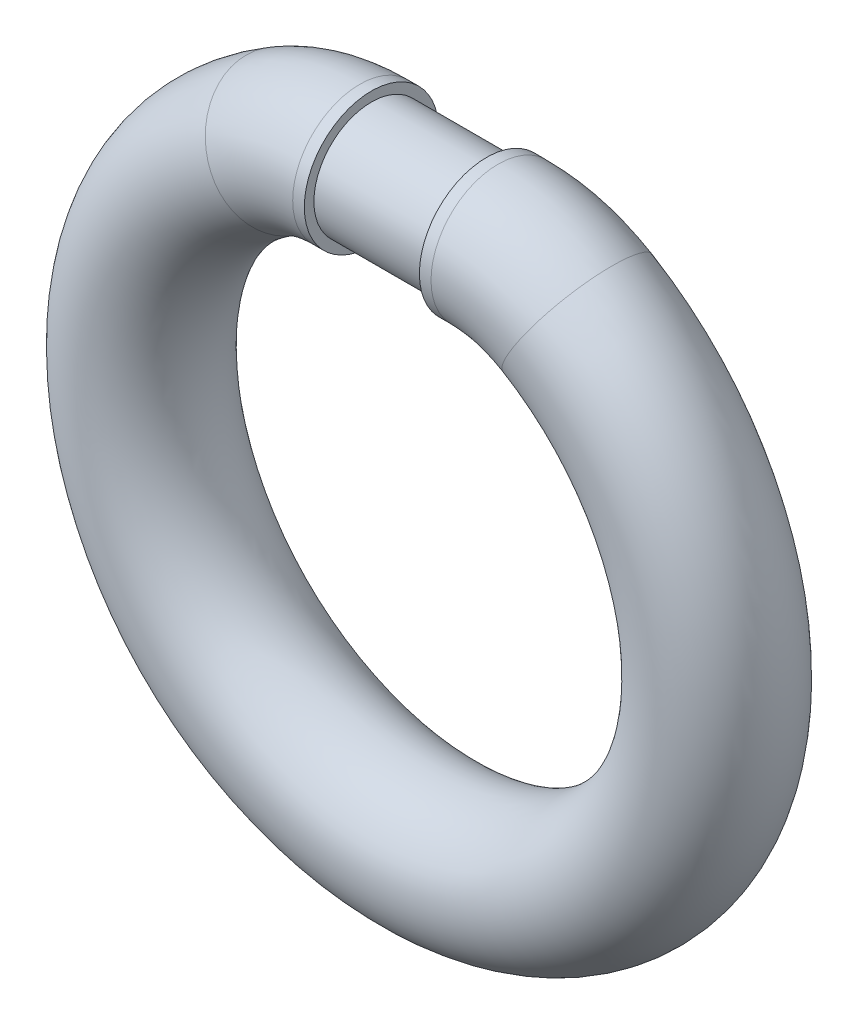
ISO-10303-21;
HEADER;
FILE_DESCRIPTION(('STEP AP214'),'2;1');
FILE_NAME('part.step','',(''),(''),'','','');
FILE_SCHEMA(('AUTOMOTIVE_DESIGN { 1 0 10303 214 1 1 1 1 }'));
ENDSEC;
DATA;
#1=APPLICATION_CONTEXT('core data for automotive mechanical design processes');
#2=APPLICATION_PROTOCOL_DEFINITION('international standard','automotive_design',2000,#1);
#3=PRODUCT_CONTEXT('',#1,'mechanical');
#4=PRODUCT('Part','Part','',(#3));
#5=PRODUCT_RELATED_PRODUCT_CATEGORY('part','',(#4));
#6=PRODUCT_DEFINITION_FORMATION('','',#4);
#7=PRODUCT_DEFINITION_CONTEXT('part definition',#1,'design');
#8=PRODUCT_DEFINITION('design','',#6,#7);
#9=PRODUCT_DEFINITION_SHAPE('','',#8);
#10=(LENGTH_UNIT() NAMED_UNIT(*) SI_UNIT(.MILLI.,.METRE.));
#11=(NAMED_UNIT(*) PLANE_ANGLE_UNIT() SI_UNIT($,.RADIAN.));
#12=(NAMED_UNIT(*) SI_UNIT($,.STERADIAN.) SOLID_ANGLE_UNIT());
#13=UNCERTAINTY_MEASURE_WITH_UNIT(LENGTH_MEASURE(1.E-05),#10,'distance_accuracy_value','');
#14=(GEOMETRIC_REPRESENTATION_CONTEXT(3) GLOBAL_UNCERTAINTY_ASSIGNED_CONTEXT((#13)) GLOBAL_UNIT_ASSIGNED_CONTEXT((#10,
#11,#12)) REPRESENTATION_CONTEXT('',''));
#15=CARTESIAN_POINT('',(0.,0.,0.));
#16=DIRECTION('',(0.,0.,1.));
#17=DIRECTION('',(1.,0.,0.));
#18=AXIS2_PLACEMENT_3D('',#15,#16,#17);
#19=CARTESIAN_POINT('',(-30.,0.,0.));
#20=DIRECTION('',(-1.,0.,0.));
#21=DIRECTION('',(0.,0.,1.));
#22=AXIS2_PLACEMENT_3D('',#19,#20,#21);
#23=PLANE('',#22);
#24=CARTESIAN_POINT('',(-30.,0.,0.));
#25=DIRECTION('',(-1.,0.,0.));
#26=DIRECTION('',(0.,0.,1.));
#27=AXIS2_PLACEMENT_3D('',#24,#25,#26);
#28=CIRCLE('',#27,30.);
#29=CARTESIAN_POINT('',(-30.,0.,30.));
#30=VERTEX_POINT('',#29);
#31=EDGE_CURVE('E11',#30,#30,#28,.T.);
#32=ORIENTED_EDGE('',*,*,#31,.T.);
#33=EDGE_LOOP('',(#32));
#34=FACE_BOUND('',#33,.T.);
#35=CARTESIAN_POINT('',(-30.,0.,0.));
#36=DIRECTION('',(-1.,0.,0.));
#37=DIRECTION('',(0.,0.,1.));
#38=AXIS2_PLACEMENT_3D('',#35,#36,#37);
#39=CIRCLE('',#38,35.);
#40=CARTESIAN_POINT('',(-30.,0.,35.));
#41=VERTEX_POINT('',#40);
#42=EDGE_CURVE('E48',#41,#41,#39,.T.);
#43=ORIENTED_EDGE('',*,*,#42,.F.);
#44=EDGE_LOOP('',(#43));
#45=FACE_BOUND('',#44,.T.);
#46=ADVANCED_FACE('F35',(#34,#45),#23,.F.);
#47=CARTESIAN_POINT('',(30.,0.,0.));
#48=DIRECTION('',(-1.,0.,0.));
#49=DIRECTION('',(0.,0.,1.));
#50=AXIS2_PLACEMENT_3D('',#47,#48,#49);
#51=PLANE('',#50);
#52=CARTESIAN_POINT('',(30.,0.,0.));
#53=DIRECTION('',(-1.,0.,0.));
#54=DIRECTION('',(0.,0.,1.));
#55=AXIS2_PLACEMENT_3D('',#52,#53,#54);
#56=CIRCLE('',#55,30.);
#57=CARTESIAN_POINT('',(30.,0.,30.));
#58=VERTEX_POINT('',#57);
#59=EDGE_CURVE('E39',#58,#58,#56,.T.);
#60=ORIENTED_EDGE('',*,*,#59,.F.);
#61=EDGE_LOOP('',(#60));
#62=FACE_BOUND('',#61,.T.);
#63=CARTESIAN_POINT('',(30.,0.,0.));
#64=DIRECTION('',(-1.,0.,0.));
#65=DIRECTION('',(0.,0.,1.));
#66=AXIS2_PLACEMENT_3D('',#63,#64,#65);
#67=CIRCLE('',#66,35.);
#68=CARTESIAN_POINT('',(30.,0.,35.));
#69=VERTEX_POINT('',#68);
#70=EDGE_CURVE('E52',#69,#69,#67,.T.);
#71=ORIENTED_EDGE('',*,*,#70,.T.);
#72=EDGE_LOOP('',(#71));
#73=FACE_BOUND('',#72,.T.);
#74=ADVANCED_FACE('F53',(#62,#73),#51,.T.);
#75=CARTESIAN_POINT('',(-30.,0.,0.));
#76=DIRECTION('',(-1.,0.,0.));
#77=DIRECTION('',(0.,0.,1.));
#78=AXIS2_PLACEMENT_3D('',#75,#76,#77);
#79=CYLINDRICAL_SURFACE('',#78,35.);
#80=CARTESIAN_POINT('',(-36.0555127546398,0.,0.));
#81=DIRECTION('',(-1.,0.,0.));
#82=DIRECTION('',(0.,0.,1.));
#83=AXIS2_PLACEMENT_3D('',#80,#81,#82);
#84=CIRCLE('',#83,35.);
#85=CARTESIAN_POINT('',(-36.0555127546398,35.,0.));
#86=VERTEX_POINT('',#85);
#87=EDGE_CURVE('E67',#86,#86,#84,.T.);
#88=ORIENTED_EDGE('',*,*,#87,.F.);
#89=EDGE_LOOP('',(#88));
#90=FACE_BOUND('',#89,.T.);
#91=ORIENTED_EDGE('',*,*,#42,.T.);
#92=EDGE_LOOP('',(#91));
#93=FACE_BOUND('',#92,.T.);
#94=ADVANCED_FACE('F71',(#90,#93),#79,.T.);
#95=CARTESIAN_POINT('',(-36.0555127546398,-80.,0.));
#96=DIRECTION('',(0.,0.,1.));
#97=DIRECTION('',(1.,0.,0.));
#98=AXIS2_PLACEMENT_3D('',#95,#96,#97);
#99=TOROIDAL_SURFACE('',#98,80.,35.);
#100=CARTESIAN_POINT('',(-77.2618130456568,-11.4285714285714,0.));
#101=DIRECTION('',(-0.857142857142857,-0.515078753637712,0.));
#102=DIRECTION('',(0.,0.,1.));
#103=AXIS2_PLACEMENT_3D('',#100,#101,#102);
#104=CIRCLE('',#103,35.);
#105=CARTESIAN_POINT('',(-95.2895694229768,18.5714285714286,0.));
#106=VERTEX_POINT('',#105);
#107=EDGE_CURVE('E64',#106,#106,#104,.T.);
#108=CARTESIAN_POINT('',(-36.0555127546398,-80.,0.));
#109=DIRECTION('',(0.,0.,1.));
#110=DIRECTION('',(1.,0.,0.));
#111=AXIS2_PLACEMENT_3D('',#108,#109,#110);
#112=CIRCLE('',#111,115.);
#113=EDGE_CURVE('',#86,#106,#112,.T.);
#114=ORIENTED_EDGE('',*,*,#87,.T.);
#115=ORIENTED_EDGE('',*,*,#107,.F.);
#116=ORIENTED_EDGE('',*,*,#113,.T.);
#117=ORIENTED_EDGE('',*,*,#113,.F.);
#118=EDGE_LOOP('',(#114,#116,#115,#117));
#119=FACE_BOUND('',#118,.T.);
#120=ADVANCED_FACE('F73',(#119),#99,.T.);
#121=CARTESIAN_POINT('',(0.,-140.,0.));
#122=DIRECTION('',(0.,0.,1.));
#123=DIRECTION('',(1.,0.,0.));
#124=AXIS2_PLACEMENT_3D('',#121,#122,#123);
#125=TOROIDAL_SURFACE('',#124,150.,35.);
#126=CARTESIAN_POINT('',(77.2618130456569,-11.4285714285714,0.));
#127=DIRECTION('',(-0.857142857142857,0.515078753637712,0.));
#128=DIRECTION('',(0.,0.,1.));
#129=AXIS2_PLACEMENT_3D('',#126,#127,#128);
#130=CIRCLE('',#129,35.);
#131=CARTESIAN_POINT('',(95.2895694229769,18.5714285714286,0.));
#132=VERTEX_POINT('',#131);
#133=EDGE_CURVE('E59',#132,#132,#130,.T.);
#134=CARTESIAN_POINT('',(0.,-140.,0.));
#135=DIRECTION('',(0.,0.,1.));
#136=DIRECTION('',(1.,0.,0.));
#137=AXIS2_PLACEMENT_3D('',#134,#135,#136);
#138=CIRCLE('',#137,185.);
#139=EDGE_CURVE('',#106,#132,#138,.T.);
#140=ORIENTED_EDGE('',*,*,#107,.T.);
#141=ORIENTED_EDGE('',*,*,#133,.F.);
#142=ORIENTED_EDGE('',*,*,#139,.T.);
#143=ORIENTED_EDGE('',*,*,#139,.F.);
#144=EDGE_LOOP('',(#140,#142,#141,#143));
#145=FACE_BOUND('',#144,.T.);
#146=ADVANCED_FACE('F80',(#145),#125,.T.);
#147=CARTESIAN_POINT('',(36.0555127546399,-80.,0.));
#148=DIRECTION('',(0.,0.,1.));
#149=DIRECTION('',(1.,0.,0.));
#150=AXIS2_PLACEMENT_3D('',#147,#148,#149);
#151=TOROIDAL_SURFACE('',#150,80.,35.);
#152=CARTESIAN_POINT('',(36.0555127546399,0.,0.));
#153=DIRECTION('',(-1.,0.,0.));
#154=DIRECTION('',(0.,0.,1.));
#155=AXIS2_PLACEMENT_3D('',#152,#153,#154);
#156=CIRCLE('',#155,35.);
#157=CARTESIAN_POINT('',(36.0555127546399,35.,0.));
#158=VERTEX_POINT('',#157);
#159=EDGE_CURVE('E55',#158,#158,#156,.T.);
#160=CARTESIAN_POINT('',(36.0555127546399,-80.,0.));
#161=DIRECTION('',(0.,0.,1.));
#162=DIRECTION('',(1.,0.,0.));
#163=AXIS2_PLACEMENT_3D('',#160,#161,#162);
#164=CIRCLE('',#163,115.);
#165=EDGE_CURVE('',#132,#158,#164,.T.);
#166=ORIENTED_EDGE('',*,*,#133,.T.);
#167=ORIENTED_EDGE('',*,*,#159,.F.);
#168=ORIENTED_EDGE('',*,*,#165,.T.);
#169=ORIENTED_EDGE('',*,*,#165,.F.);
#170=EDGE_LOOP('',(#166,#168,#167,#169));
#171=FACE_BOUND('',#170,.T.);
#172=ADVANCED_FACE('F88',(#171),#151,.T.);
#173=CARTESIAN_POINT('',(36.0555127546399,0.,0.));
#174=DIRECTION('',(-1.,0.,0.));
#175=DIRECTION('',(0.,0.,1.));
#176=AXIS2_PLACEMENT_3D('',#173,#174,#175);
#177=CYLINDRICAL_SURFACE('',#176,35.);
#178=ORIENTED_EDGE('',*,*,#70,.F.);
#179=EDGE_LOOP('',(#178));
#180=FACE_BOUND('',#179,.T.);
#181=ORIENTED_EDGE('',*,*,#159,.T.);
#182=EDGE_LOOP('',(#181));
#183=FACE_BOUND('',#182,.T.);
#184=ADVANCED_FACE('F86',(#180,#183),#177,.T.);
#185=CARTESIAN_POINT('',(-50.2564102564103,0.,0.));
#186=DIRECTION('',(-1.,0.,0.));
#187=DIRECTION('',(0.,0.,1.));
#188=AXIS2_PLACEMENT_3D('',#185,#186,#187);
#189=CYLINDRICAL_SURFACE('',#188,30.);
#190=ORIENTED_EDGE('',*,*,#31,.F.);
#191=EDGE_LOOP('',(#190));
#192=FACE_BOUND('',#191,.T.);
#193=ORIENTED_EDGE('',*,*,#59,.T.);
#194=EDGE_LOOP('',(#193));
#195=FACE_BOUND('',#194,.T.);
#196=ADVANCED_FACE('F37',(#192,#195),#189,.T.);
#197=CLOSED_SHELL('',(#46,#74,#94,#120,#146,#172,#184,#196));
#198=MANIFOLD_SOLID_BREP('B2',#197);
#199=ADVANCED_BREP_SHAPE_REPRESENTATION('',(#18,#198),#14);
#200=SHAPE_DEFINITION_REPRESENTATION(#9,#199);
ENDSEC;
END-ISO-10303-21;
